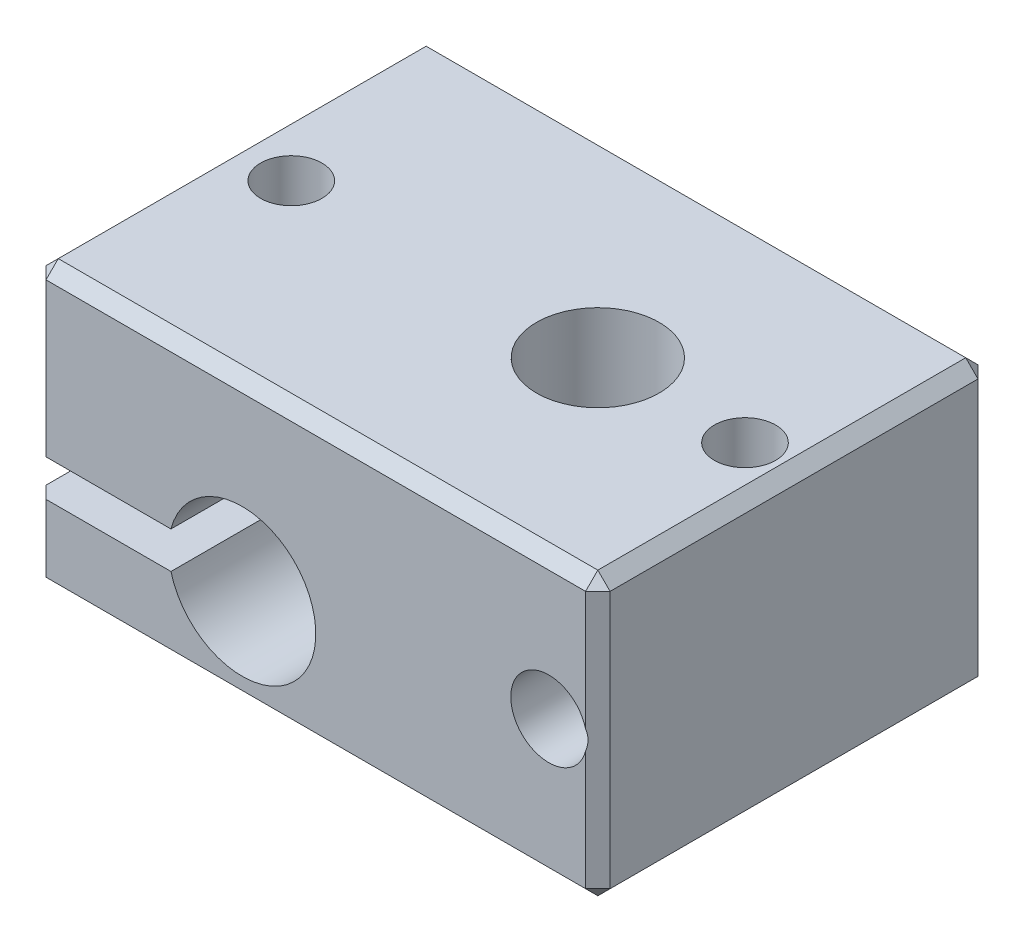
ISO-10303-21;
HEADER;
FILE_DESCRIPTION(('STEP AP214'),'2;1');
FILE_NAME('part.step','',(''),(''),'','','');
FILE_SCHEMA(('AUTOMOTIVE_DESIGN { 1 0 10303 214 1 1 1 1 }'));
ENDSEC;
DATA;
#1=APPLICATION_CONTEXT('core data for automotive mechanical design processes');
#2=APPLICATION_PROTOCOL_DEFINITION('international standard','automotive_design',2000,#1);
#3=PRODUCT_CONTEXT('',#1,'mechanical');
#4=PRODUCT('Part','Part','',(#3));
#5=PRODUCT_RELATED_PRODUCT_CATEGORY('part','',(#4));
#6=PRODUCT_DEFINITION_FORMATION('','',#4);
#7=PRODUCT_DEFINITION_CONTEXT('part definition',#1,'design');
#8=PRODUCT_DEFINITION('design','',#6,#7);
#9=PRODUCT_DEFINITION_SHAPE('','',#8);
#10=(LENGTH_UNIT() NAMED_UNIT(*) SI_UNIT(.MILLI.,.METRE.));
#11=(NAMED_UNIT(*) PLANE_ANGLE_UNIT() SI_UNIT($,.RADIAN.));
#12=(NAMED_UNIT(*) SI_UNIT($,.STERADIAN.) SOLID_ANGLE_UNIT());
#13=UNCERTAINTY_MEASURE_WITH_UNIT(LENGTH_MEASURE(1.E-05),#10,'distance_accuracy_value','');
#14=(GEOMETRIC_REPRESENTATION_CONTEXT(3) GLOBAL_UNCERTAINTY_ASSIGNED_CONTEXT((#13)) GLOBAL_UNIT_ASSIGNED_CONTEXT((#10,
#11,#12)) REPRESENTATION_CONTEXT('',''));
#15=CARTESIAN_POINT('',(0.,0.,0.));
#16=DIRECTION('',(0.,0.,1.));
#17=DIRECTION('',(1.,0.,0.));
#18=AXIS2_PLACEMENT_3D('',#15,#16,#17);
#19=CARTESIAN_POINT('',(0.,11.5,0.));
#20=DIRECTION('',(1.,0.,0.));
#21=DIRECTION('',(0.,0.,-1.));
#22=AXIS2_PLACEMENT_3D('',#19,#20,#21);
#23=PLANE('',#22);
#24=DIRECTION('',(0.,0.,-1.));
#25=VECTOR('',#24,1.);
#26=CARTESIAN_POINT('',(0.,11.,0.));
#27=LINE('',#26,#25);
#28=CARTESIAN_POINT('',(0.,11.,-0.5));
#29=VERTEX_POINT('',#28);
#30=CARTESIAN_POINT('',(0.,11.,-15.5));
#31=VERTEX_POINT('',#30);
#32=EDGE_CURVE('E321',#29,#31,#27,.T.);
#33=ORIENTED_EDGE('',*,*,#32,.T.);
#34=DIRECTION('',(0.,-1.,0.));
#35=VECTOR('',#34,1.);
#36=CARTESIAN_POINT('',(0.,11.5,-15.5));
#37=LINE('',#36,#35);
#38=CARTESIAN_POINT('',(0.,4.75,-15.5));
#39=VERTEX_POINT('',#38);
#40=EDGE_CURVE('E325',#31,#39,#37,.T.);
#41=ORIENTED_EDGE('',*,*,#40,.T.);
#42=DIRECTION('',(0.,0.,1.));
#43=VECTOR('',#42,1.);
#44=CARTESIAN_POINT('',(0.,4.75,-16.));
#45=LINE('',#44,#43);
#46=CARTESIAN_POINT('',(0.,4.75,-0.5));
#47=VERTEX_POINT('',#46);
#48=EDGE_CURVE('E213',#39,#47,#45,.T.);
#49=ORIENTED_EDGE('',*,*,#48,.T.);
#50=DIRECTION('',(0.,1.,0.));
#51=VECTOR('',#50,1.);
#52=CARTESIAN_POINT('',(0.,11.5,-0.5));
#53=LINE('',#52,#51);
#54=EDGE_CURVE('E323',#47,#29,#53,.T.);
#55=ORIENTED_EDGE('',*,*,#54,.T.);
#56=EDGE_LOOP('',(#33,#41,#49,#55));
#57=FACE_BOUND('',#56,.T.);
#58=ADVANCED_FACE('F41',(#57),#23,.F.);
#59=CARTESIAN_POINT('',(2.5,11.5,-8.));
#60=DIRECTION('',(0.,1.,0.));
#61=DIRECTION('',(0.,0.,1.));
#62=AXIS2_PLACEMENT_3D('',#59,#60,#61);
#63=CYLINDRICAL_SURFACE('',#62,1.24999999999999);
#64=CARTESIAN_POINT('',(2.5,11.5,-8.));
#65=DIRECTION('',(0.,1.,0.));
#66=DIRECTION('',(0.,0.,1.));
#67=AXIS2_PLACEMENT_3D('',#64,#65,#66);
#68=CIRCLE('',#67,1.24999999999999);
#69=CARTESIAN_POINT('',(2.5,11.5,-6.75000000000001));
#70=VERTEX_POINT('',#69);
#71=EDGE_CURVE('E224',#70,#70,#68,.T.);
#72=ORIENTED_EDGE('',*,*,#71,.T.);
#73=EDGE_LOOP('',(#72));
#74=FACE_BOUND('',#73,.T.);
#75=CARTESIAN_POINT('',(2.5,4.75,-8.));
#76=DIRECTION('',(0.,-1.,0.));
#77=DIRECTION('',(0.,0.,-1.));
#78=AXIS2_PLACEMENT_3D('',#75,#76,#77);
#79=CIRCLE('',#78,1.24999999999999);
#80=CARTESIAN_POINT('',(2.5,4.75,-9.24999999999999));
#81=VERTEX_POINT('',#80);
#82=EDGE_CURVE('E212',#81,#81,#79,.F.);
#83=ORIENTED_EDGE('',*,*,#82,.F.);
#84=EDGE_LOOP('',(#83));
#85=FACE_BOUND('',#84,.T.);
#86=ADVANCED_FACE('F257',(#74,#85),#63,.F.);
#87=DIRECTION('',(0.,0.,1.));
#88=VECTOR('',#87,1.);
#89=CARTESIAN_POINT('',(0.,3.25,-16.));
#90=LINE('',#89,#88);
#91=CARTESIAN_POINT('',(0.,3.25,-15.5));
#92=VERTEX_POINT('',#91);
#93=CARTESIAN_POINT('',(0.,3.25,-0.5));
#94=VERTEX_POINT('',#93);
#95=EDGE_CURVE('E209',#92,#94,#90,.T.);
#96=ORIENTED_EDGE('',*,*,#95,.F.);
#97=DIRECTION('',(0.,-1.,0.));
#98=VECTOR('',#97,1.);
#99=CARTESIAN_POINT('',(0.,11.5,-15.5));
#100=LINE('',#99,#98);
#101=CARTESIAN_POINT('',(0.,0.500000000000004,-15.5));
#102=VERTEX_POINT('',#101);
#103=EDGE_CURVE('E292',#92,#102,#100,.T.);
#104=ORIENTED_EDGE('',*,*,#103,.T.);
#105=DIRECTION('',(0.,0.,1.));
#106=VECTOR('',#105,1.);
#107=CARTESIAN_POINT('',(0.,0.500000000000004,0.));
#108=LINE('',#107,#106);
#109=CARTESIAN_POINT('',(0.,0.500000000000004,-0.5));
#110=VERTEX_POINT('',#109);
#111=EDGE_CURVE('E303',#102,#110,#108,.T.);
#112=ORIENTED_EDGE('',*,*,#111,.T.);
#113=DIRECTION('',(0.,1.,0.));
#114=VECTOR('',#113,1.);
#115=CARTESIAN_POINT('',(0.,11.5,-0.5));
#116=LINE('',#115,#114);
#117=EDGE_CURVE('E294',#110,#94,#116,.T.);
#118=ORIENTED_EDGE('',*,*,#117,.T.);
#119=EDGE_LOOP('',(#96,#104,#112,#118));
#120=FACE_BOUND('',#119,.T.);
#121=ADVANCED_FACE('F275',(#120),#23,.F.);
#122=CARTESIAN_POINT('',(0.,11.5,0.));
#123=DIRECTION('',(0.,0.,-1.));
#124=DIRECTION('',(-1.,0.,0.));
#125=AXIS2_PLACEMENT_3D('',#122,#123,#124);
#126=PLANE('',#125);
#127=DIRECTION('',(1.,0.,0.));
#128=VECTOR('',#127,1.);
#129=CARTESIAN_POINT('',(0.,3.25,0.));
#130=LINE('',#129,#128);
#131=CARTESIAN_POINT('',(0.500000000000004,3.25,0.));
#132=VERTEX_POINT('',#131);
#133=CARTESIAN_POINT('',(5.59526249034444,3.25,0.));
#134=VERTEX_POINT('',#133);
#135=EDGE_CURVE('E192',#132,#134,#130,.T.);
#136=ORIENTED_EDGE('',*,*,#135,.F.);
#137=DIRECTION('',(0.,-1.,0.));
#138=VECTOR('',#137,1.);
#139=CARTESIAN_POINT('',(0.500000000000004,11.5,0.));
#140=LINE('',#139,#138);
#141=CARTESIAN_POINT('',(0.500000000000004,0.500000000000004,0.));
#142=VERTEX_POINT('',#141);
#143=EDGE_CURVE('E11',#132,#142,#140,.T.);
#144=ORIENTED_EDGE('',*,*,#143,.T.);
#145=DIRECTION('',(1.,0.,0.));
#146=VECTOR('',#145,1.);
#147=CARTESIAN_POINT('',(23.,0.500000000000004,0.));
#148=LINE('',#147,#146);
#149=CARTESIAN_POINT('',(22.5,0.500000000000004,0.));
#150=VERTEX_POINT('',#149);
#151=EDGE_CURVE('E50',#142,#150,#148,.T.);
#152=ORIENTED_EDGE('',*,*,#151,.T.);
#153=DIRECTION('',(0.,1.,0.));
#154=VECTOR('',#153,1.);
#155=CARTESIAN_POINT('',(22.5,11.5,0.));
#156=LINE('',#155,#154);
#157=CARTESIAN_POINT('',(22.5,5.35948751620467,0.));
#158=VERTEX_POINT('',#157);
#159=EDGE_CURVE('E371',#150,#158,#156,.T.);
#160=ORIENTED_EDGE('',*,*,#159,.T.);
#161=CARTESIAN_POINT('',(21.,5.75,0.));
#162=DIRECTION('',(0.,0.,1.));
#163=DIRECTION('',(1.,0.,0.));
#164=AXIS2_PLACEMENT_3D('',#161,#162,#163);
#165=CIRCLE('',#164,1.55);
#166=CARTESIAN_POINT('',(22.5,6.14051248379533,0.));
#167=VERTEX_POINT('',#166);
#168=EDGE_CURVE('E241',#167,#158,#165,.T.);
#169=ORIENTED_EDGE('',*,*,#168,.F.);
#170=DIRECTION('',(0.,1.,0.));
#171=VECTOR('',#170,1.);
#172=CARTESIAN_POINT('',(22.5,11.5,0.));
#173=LINE('',#172,#171);
#174=CARTESIAN_POINT('',(22.5,11.,0.));
#175=VERTEX_POINT('',#174);
#176=EDGE_CURVE('E369',#167,#175,#173,.T.);
#177=ORIENTED_EDGE('',*,*,#176,.T.);
#178=DIRECTION('',(-1.,0.,0.));
#179=VECTOR('',#178,1.);
#180=CARTESIAN_POINT('',(0.,11.,0.));
#181=LINE('',#180,#179);
#182=CARTESIAN_POINT('',(0.500000000000004,11.,0.));
#183=VERTEX_POINT('',#182);
#184=EDGE_CURVE('E365',#175,#183,#181,.T.);
#185=ORIENTED_EDGE('',*,*,#184,.T.);
#186=DIRECTION('',(0.,-1.,0.));
#187=VECTOR('',#186,1.);
#188=CARTESIAN_POINT('',(0.500000000000004,11.5,0.));
#189=LINE('',#188,#187);
#190=CARTESIAN_POINT('',(0.500000000000004,4.75,0.));
#191=VERTEX_POINT('',#190);
#192=EDGE_CURVE('E367',#183,#191,#189,.T.);
#193=ORIENTED_EDGE('',*,*,#192,.T.);
#194=DIRECTION('',(1.,0.,0.));
#195=VECTOR('',#194,1.);
#196=CARTESIAN_POINT('',(0.,4.75,0.));
#197=LINE('',#196,#195);
#198=CARTESIAN_POINT('',(5.59526249034444,4.75,0.));
#199=VERTEX_POINT('',#198);
#200=EDGE_CURVE('E186',#191,#199,#197,.T.);
#201=ORIENTED_EDGE('',*,*,#200,.T.);
#202=CARTESIAN_POINT('',(8.5,4.,0.));
#203=DIRECTION('',(0.,0.,1.));
#204=DIRECTION('',(1.,0.,0.));
#205=AXIS2_PLACEMENT_3D('',#202,#203,#204);
#206=CIRCLE('',#205,3.);
#207=EDGE_CURVE('E206',#134,#199,#206,.T.);
#208=ORIENTED_EDGE('',*,*,#207,.F.);
#209=EDGE_LOOP('',(#136,#144,#152,#160,#169,#177,#185,#193,#201,#208));
#210=FACE_BOUND('',#209,.T.);
#211=ADVANCED_FACE('F283',(#210),#126,.F.);
#212=CARTESIAN_POINT('',(23.,11.5,0.));
#213=DIRECTION('',(-1.,0.,0.));
#214=DIRECTION('',(0.,0.,1.));
#215=AXIS2_PLACEMENT_3D('',#212,#213,#214);
#216=PLANE('',#215);
#217=DIRECTION('',(0.,1.,0.));
#218=VECTOR('',#217,1.);
#219=CARTESIAN_POINT('',(23.,11.5,-15.5));
#220=LINE('',#219,#218);
#221=CARTESIAN_POINT('',(23.,0.500000000000004,-15.5));
#222=VERTEX_POINT('',#221);
#223=CARTESIAN_POINT('',(23.,11.,-15.5));
#224=VERTEX_POINT('',#223);
#225=EDGE_CURVE('E356',#222,#224,#220,.T.);
#226=ORIENTED_EDGE('',*,*,#225,.T.);
#227=DIRECTION('',(0.,0.,1.));
#228=VECTOR('',#227,1.);
#229=CARTESIAN_POINT('',(23.,11.,0.));
#230=LINE('',#229,#228);
#231=CARTESIAN_POINT('',(23.,11.,-0.500000000000004));
#232=VERTEX_POINT('',#231);
#233=EDGE_CURVE('E358',#224,#232,#230,.T.);
#234=ORIENTED_EDGE('',*,*,#233,.T.);
#235=DIRECTION('',(0.,-1.,0.));
#236=VECTOR('',#235,1.);
#237=CARTESIAN_POINT('',(23.,11.5,-0.500000000000004));
#238=LINE('',#237,#236);
#239=CARTESIAN_POINT('',(23.,0.500000000000004,-0.500000000000004));
#240=VERTEX_POINT('',#239);
#241=EDGE_CURVE('E351',#232,#240,#238,.T.);
#242=ORIENTED_EDGE('',*,*,#241,.T.);
#243=DIRECTION('',(0.,0.,-1.));
#244=VECTOR('',#243,1.);
#245=CARTESIAN_POINT('',(23.,0.500000000000004,-16.));
#246=LINE('',#245,#244);
#247=EDGE_CURVE('E353',#240,#222,#246,.T.);
#248=ORIENTED_EDGE('',*,*,#247,.T.);
#249=EDGE_LOOP('',(#226,#234,#242,#248));
#250=FACE_BOUND('',#249,.T.);
#251=ADVANCED_FACE('F288',(#250),#216,.F.);
#252=CARTESIAN_POINT('',(0.,11.5,-16.));
#253=DIRECTION('',(0.,0.,1.));
#254=DIRECTION('',(1.,0.,0.));
#255=AXIS2_PLACEMENT_3D('',#252,#253,#254);
#256=PLANE('',#255);
#257=DIRECTION('',(-1.,0.,0.));
#258=VECTOR('',#257,1.);
#259=CARTESIAN_POINT('',(0.,0.5,-16.));
#260=LINE('',#259,#258);
#261=CARTESIAN_POINT('',(22.5,0.5,-16.));
#262=VERTEX_POINT('',#261);
#263=CARTESIAN_POINT('',(0.5,0.5,-16.));
#264=VERTEX_POINT('',#263);
#265=EDGE_CURVE('E315',#262,#264,#260,.T.);
#266=ORIENTED_EDGE('',*,*,#265,.T.);
#267=DIRECTION('',(0.,1.,0.));
#268=VECTOR('',#267,1.);
#269=CARTESIAN_POINT('',(0.5,11.5,-16.));
#270=LINE('',#269,#268);
#271=CARTESIAN_POINT('',(0.5,3.25,-16.));
#272=VERTEX_POINT('',#271);
#273=EDGE_CURVE('E183',#264,#272,#270,.T.);
#274=ORIENTED_EDGE('',*,*,#273,.T.);
#275=DIRECTION('',(1.,0.,0.));
#276=VECTOR('',#275,1.);
#277=CARTESIAN_POINT('',(0.,3.25,-16.));
#278=LINE('',#277,#276);
#279=CARTESIAN_POINT('',(5.59526249034444,3.25,-16.));
#280=VERTEX_POINT('',#279);
#281=EDGE_CURVE('E176',#272,#280,#278,.T.);
#282=ORIENTED_EDGE('',*,*,#281,.T.);
#283=CARTESIAN_POINT('',(8.5,4.,-16.));
#284=DIRECTION('',(0.,0.,1.));
#285=DIRECTION('',(1.,0.,0.));
#286=AXIS2_PLACEMENT_3D('',#283,#284,#285);
#287=CIRCLE('',#286,3.);
#288=CARTESIAN_POINT('',(5.59526249034444,4.75,-16.));
#289=VERTEX_POINT('',#288);
#290=EDGE_CURVE('E181',#280,#289,#287,.T.);
#291=ORIENTED_EDGE('',*,*,#290,.T.);
#292=DIRECTION('',(1.,0.,0.));
#293=VECTOR('',#292,1.);
#294=CARTESIAN_POINT('',(0.,4.75,-16.));
#295=LINE('',#294,#293);
#296=CARTESIAN_POINT('',(0.5,4.75,-16.));
#297=VERTEX_POINT('',#296);
#298=EDGE_CURVE('E197',#297,#289,#295,.T.);
#299=ORIENTED_EDGE('',*,*,#298,.F.);
#300=DIRECTION('',(0.,1.,0.));
#301=VECTOR('',#300,1.);
#302=CARTESIAN_POINT('',(0.5,11.5,-16.));
#303=LINE('',#302,#301);
#304=CARTESIAN_POINT('',(0.5,11.,-16.));
#305=VERTEX_POINT('',#304);
#306=EDGE_CURVE('E311',#297,#305,#303,.T.);
#307=ORIENTED_EDGE('',*,*,#306,.T.);
#308=DIRECTION('',(1.,0.,0.));
#309=VECTOR('',#308,1.);
#310=CARTESIAN_POINT('',(0.,11.,-16.));
#311=LINE('',#310,#309);
#312=CARTESIAN_POINT('',(22.5,11.,-16.));
#313=VERTEX_POINT('',#312);
#314=EDGE_CURVE('E302',#305,#313,#311,.T.);
#315=ORIENTED_EDGE('',*,*,#314,.T.);
#316=DIRECTION('',(0.,-1.,0.));
#317=VECTOR('',#316,1.);
#318=CARTESIAN_POINT('',(22.5,11.5,-16.));
#319=LINE('',#318,#317);
#320=CARTESIAN_POINT('',(22.5,6.14051248379533,-16.));
#321=VERTEX_POINT('',#320);
#322=EDGE_CURVE('E305',#313,#321,#319,.T.);
#323=ORIENTED_EDGE('',*,*,#322,.T.);
#324=CARTESIAN_POINT('',(21.,5.75,-16.));
#325=DIRECTION('',(0.,0.,1.));
#326=DIRECTION('',(1.,0.,0.));
#327=AXIS2_PLACEMENT_3D('',#324,#325,#326);
#328=CIRCLE('',#327,1.55);
#329=CARTESIAN_POINT('',(22.5,5.35948751620467,-16.));
#330=VERTEX_POINT('',#329);
#331=EDGE_CURVE('E242',#321,#330,#328,.T.);
#332=ORIENTED_EDGE('',*,*,#331,.T.);
#333=DIRECTION('',(0.,-1.,0.));
#334=VECTOR('',#333,1.);
#335=CARTESIAN_POINT('',(22.5,11.5,-16.));
#336=LINE('',#335,#334);
#337=EDGE_CURVE('E313',#330,#262,#336,.T.);
#338=ORIENTED_EDGE('',*,*,#337,.T.);
#339=EDGE_LOOP('',(#266,#274,#282,#291,#299,#307,#315,#323,#332,#338));
#340=FACE_BOUND('',#339,.T.);
#341=ADVANCED_FACE('F178',(#340),#256,.F.);
#342=CARTESIAN_POINT('',(0.,11.5,0.));
#343=DIRECTION('',(0.,-1.,0.));
#344=DIRECTION('',(0.,0.,-1.));
#345=AXIS2_PLACEMENT_3D('',#342,#343,#344);
#346=PLANE('',#345);
#347=DIRECTION('',(1.,0.,0.));
#348=VECTOR('',#347,1.);
#349=CARTESIAN_POINT('',(0.,11.5,-0.500000000000004));
#350=LINE('',#349,#348);
#351=CARTESIAN_POINT('',(0.500000000000004,11.5,-0.500000000000004));
#352=VERTEX_POINT('',#351);
#353=CARTESIAN_POINT('',(22.5,11.5,-0.500000000000004));
#354=VERTEX_POINT('',#353);
#355=EDGE_CURVE('E346',#352,#354,#350,.T.);
#356=ORIENTED_EDGE('',*,*,#355,.T.);
#357=DIRECTION('',(0.,0.,-1.));
#358=VECTOR('',#357,1.);
#359=CARTESIAN_POINT('',(22.5,11.5,0.));
#360=LINE('',#359,#358);
#361=CARTESIAN_POINT('',(22.5,11.5,-15.5));
#362=VERTEX_POINT('',#361);
#363=EDGE_CURVE('E348',#354,#362,#360,.T.);
#364=ORIENTED_EDGE('',*,*,#363,.T.);
#365=DIRECTION('',(-1.,0.,0.));
#366=VECTOR('',#365,1.);
#367=CARTESIAN_POINT('',(0.,11.5,-15.5));
#368=LINE('',#367,#366);
#369=CARTESIAN_POINT('',(0.500000000000004,11.5,-15.5));
#370=VERTEX_POINT('',#369);
#371=EDGE_CURVE('E342',#362,#370,#368,.T.);
#372=ORIENTED_EDGE('',*,*,#371,.T.);
#373=DIRECTION('',(0.,0.,1.));
#374=VECTOR('',#373,1.);
#375=CARTESIAN_POINT('',(0.500000000000004,11.5,0.));
#376=LINE('',#375,#374);
#377=EDGE_CURVE('E344',#370,#352,#376,.T.);
#378=ORIENTED_EDGE('',*,*,#377,.T.);
#379=EDGE_LOOP('',(#356,#364,#372,#378));
#380=FACE_BOUND('',#379,.T.);
#381=CARTESIAN_POINT('',(15.,11.5,-8.));
#382=DIRECTION('',(0.,1.,0.));
#383=DIRECTION('',(0.,0.,1.));
#384=AXIS2_PLACEMENT_3D('',#381,#382,#383);
#385=CIRCLE('',#384,2.49999999999999);
#386=CARTESIAN_POINT('',(15.,11.5,-5.50000000000001));
#387=VERTEX_POINT('',#386);
#388=EDGE_CURVE('E217',#387,#387,#385,.T.);
#389=ORIENTED_EDGE('',*,*,#388,.F.);
#390=EDGE_LOOP('',(#389));
#391=FACE_BOUND('',#390,.T.);
#392=ORIENTED_EDGE('',*,*,#71,.F.);
#393=EDGE_LOOP('',(#392));
#394=FACE_BOUND('',#393,.T.);
#395=CARTESIAN_POINT('',(21.,11.5,-8.));
#396=DIRECTION('',(0.,1.,0.));
#397=DIRECTION('',(0.,0.,1.));
#398=AXIS2_PLACEMENT_3D('',#395,#396,#397);
#399=CIRCLE('',#398,1.24999999999999);
#400=CARTESIAN_POINT('',(21.,11.5,-6.75000000000001));
#401=VERTEX_POINT('',#400);
#402=EDGE_CURVE('E230',#401,#401,#399,.T.);
#403=ORIENTED_EDGE('',*,*,#402,.F.);
#404=EDGE_LOOP('',(#403));
#405=FACE_BOUND('',#404,.T.);
#406=ADVANCED_FACE('F488',(#380,#391,#394,#405),#346,.F.);
#407=CARTESIAN_POINT('',(0.,0.,0.));
#408=DIRECTION('',(0.,-1.,0.));
#409=DIRECTION('',(0.,0.,-1.));
#410=AXIS2_PLACEMENT_3D('',#407,#408,#409);
#411=PLANE('',#410);
#412=DIRECTION('',(-1.,0.,0.));
#413=VECTOR('',#412,1.);
#414=CARTESIAN_POINT('',(0.,0.,-0.5));
#415=LINE('',#414,#413);
#416=CARTESIAN_POINT('',(22.5,0.,-0.5));
#417=VERTEX_POINT('',#416);
#418=CARTESIAN_POINT('',(0.5,0.,-0.5));
#419=VERTEX_POINT('',#418);
#420=EDGE_CURVE('E331',#417,#419,#415,.T.);
#421=ORIENTED_EDGE('',*,*,#420,.T.);
#422=DIRECTION('',(0.,0.,-1.));
#423=VECTOR('',#422,1.);
#424=CARTESIAN_POINT('',(0.5,0.,-16.));
#425=LINE('',#424,#423);
#426=CARTESIAN_POINT('',(0.5,0.,-15.5));
#427=VERTEX_POINT('',#426);
#428=EDGE_CURVE('E339',#419,#427,#425,.T.);
#429=ORIENTED_EDGE('',*,*,#428,.T.);
#430=DIRECTION('',(1.,0.,0.));
#431=VECTOR('',#430,1.);
#432=CARTESIAN_POINT('',(23.,0.,-15.5));
#433=LINE('',#432,#431);
#434=CARTESIAN_POINT('',(22.5,0.,-15.5));
#435=VERTEX_POINT('',#434);
#436=EDGE_CURVE('E337',#427,#435,#433,.T.);
#437=ORIENTED_EDGE('',*,*,#436,.T.);
#438=DIRECTION('',(0.,0.,1.));
#439=VECTOR('',#438,1.);
#440=CARTESIAN_POINT('',(22.5,0.,0.));
#441=LINE('',#440,#439);
#442=EDGE_CURVE('E334',#435,#417,#441,.T.);
#443=ORIENTED_EDGE('',*,*,#442,.T.);
#444=EDGE_LOOP('',(#421,#429,#437,#443));
#445=FACE_BOUND('',#444,.T.);
#446=CARTESIAN_POINT('',(15.,0.,-8.));
#447=DIRECTION('',(0.,1.,0.));
#448=DIRECTION('',(0.,0.,1.));
#449=AXIS2_PLACEMENT_3D('',#446,#447,#448);
#450=CIRCLE('',#449,2.5);
#451=CARTESIAN_POINT('',(15.,0.,-5.50000000000001));
#452=VERTEX_POINT('',#451);
#453=EDGE_CURVE('E220',#452,#452,#450,.T.);
#454=ORIENTED_EDGE('',*,*,#453,.T.);
#455=EDGE_LOOP('',(#454));
#456=FACE_BOUND('',#455,.T.);
#457=CARTESIAN_POINT('',(2.5,0.,-8.));
#458=DIRECTION('',(0.,-1.,0.));
#459=DIRECTION('',(0.,0.,-1.));
#460=AXIS2_PLACEMENT_3D('',#457,#458,#459);
#461=CIRCLE('',#460,1.24999999999999);
#462=CARTESIAN_POINT('',(2.5,0.,-9.24999999999999));
#463=VERTEX_POINT('',#462);
#464=EDGE_CURVE('E227',#463,#463,#461,.T.);
#465=ORIENTED_EDGE('',*,*,#464,.F.);
#466=EDGE_LOOP('',(#465));
#467=FACE_BOUND('',#466,.T.);
#468=ADVANCED_FACE('F486',(#445,#456,#467),#411,.T.);
#469=CARTESIAN_POINT('',(21.,5.75,-16.));
#470=DIRECTION('',(0.,0.,1.));
#471=DIRECTION('',(1.,0.,0.));
#472=AXIS2_PLACEMENT_3D('',#469,#470,#471);
#473=CYLINDRICAL_SURFACE('',#472,1.55);
#474=CARTESIAN_POINT('',(21.,7.3,-6.75000000000001));
#475=CARTESIAN_POINT('',(21.0598892809909,7.29999505953035,-6.75000508060894));
#476=CARTESIAN_POINT('',(21.1198448147391,7.29649449353118,-6.75433869661009));
#477=CARTESIAN_POINT('',(21.2378088351429,7.28280476443067,-6.77137677750278));
#478=CARTESIAN_POINT('',(21.2958137707061,7.2726040304315,-6.78409572363545));
#479=CARTESIAN_POINT('',(21.4078652549227,7.24647462705167,-6.81698036290084));
#480=CARTESIAN_POINT('',(21.4619340004093,7.23058165445636,-6.83709966815181));
#481=CARTESIAN_POINT('',(21.5654950318761,7.19420715596626,-6.88377997849981));
#482=CARTESIAN_POINT('',(21.6149867430684,7.17372505486709,-6.91034179113944));
#483=CARTESIAN_POINT('',(21.7254535915895,7.12154799488093,-6.97930258260524));
#484=CARTESIAN_POINT('',(21.7843376032748,7.08844407130947,-7.02398499785542));
#485=CARTESIAN_POINT('',(21.8925143949093,7.01888548996761,-7.12178538227406));
#486=CARTESIAN_POINT('',(21.9417788955574,6.98242140316723,-7.17492741367408));
#487=CARTESIAN_POINT('',(22.0311676485552,6.90870438902473,-7.28966264719342));
#488=CARTESIAN_POINT('',(22.0711301918294,6.87144827814355,-7.35137925512715));
#489=CARTESIAN_POINT('',(22.1403077996914,6.80100245223141,-7.48262669648232));
#490=CARTESIAN_POINT('',(22.1695581057008,6.76779964731762,-7.55213090619391));
#491=CARTESIAN_POINT('',(22.2057720399277,6.72419167436202,-7.66753628450255));
#492=CARTESIAN_POINT('',(22.2169094735222,6.71012489387374,-7.71072180027161));
#493=CARTESIAN_POINT('',(22.234610614028,6.68725468393275,-7.7993299426072));
#494=CARTESIAN_POINT('',(22.2411856736356,6.6784381978257,-7.84474671300843));
#495=CARTESIAN_POINT('',(22.2492963489852,6.66750313955801,-7.93730983081388));
#496=CARTESIAN_POINT('',(22.25078441298,6.66544777506487,-7.98446835509039));
#497=CARTESIAN_POINT('',(22.2484246653356,6.66866072212834,-8.07841239593764));
#498=CARTESIAN_POINT('',(22.2445729314499,6.67393441711259,-8.12519761290679));
#499=CARTESIAN_POINT('',(22.2309972258897,6.69195759613478,-8.22351250695992));
#500=CARTESIAN_POINT('',(22.2205038602474,6.70567881731784,-8.27474850566073));
#501=CARTESIAN_POINT('',(22.1938885766394,6.73872575660048,-8.37387252409465));
#502=CARTESIAN_POINT('',(22.1777496322926,6.7580683980236,-8.42174988421069));
#503=CARTESIAN_POINT('',(22.1310094406375,6.81070572623625,-8.53756461204011));
#504=CARTESIAN_POINT('',(22.0972315313788,6.84608098010005,-8.60326000663281));
#505=CARTESIAN_POINT('',(22.0194331392835,6.9188099095198,-8.72705224000209));
#506=CARTESIAN_POINT('',(21.9753970332117,6.95616653499973,-8.78513727522479));
#507=CARTESIAN_POINT('',(21.8758099163534,7.03040472376249,-8.89505245788434));
#508=CARTESIAN_POINT('',(21.8199481575349,7.06723688801658,-8.94663723347919));
#509=CARTESIAN_POINT('',(21.6978506617392,7.13577751282476,-9.03988910513875));
#510=CARTESIAN_POINT('',(21.6316427829299,7.16749928091645,-9.08158209805518));
#511=CARTESIAN_POINT('',(21.5098977173949,7.21474707386757,-9.14269044564161));
#512=CARTESIAN_POINT('',(21.4566408765756,7.2323160847474,-9.16507133834711));
#513=CARTESIAN_POINT('',(21.3461495843918,7.26193298467064,-9.20252818181064));
#514=CARTESIAN_POINT('',(21.2889181259619,7.27398497727426,-9.21760956242861));
#515=CARTESIAN_POINT('',(21.1715704515023,7.29162268594998,-9.23961455198698));
#516=CARTESIAN_POINT('',(21.1114399190763,7.29717194073946,-9.2464921656788));
#517=CARTESIAN_POINT('',(20.9905837258055,7.30114876216378,-9.25142520240247));
#518=CARTESIAN_POINT('',(20.9298582216542,7.29957815613483,-9.24948288909802));
#519=CARTESIAN_POINT('',(20.8152039172759,7.28992554933875,-9.23748986080134));
#520=CARTESIAN_POINT('',(20.7611460690776,7.28242661712228,-9.22816511589808));
#521=CARTESIAN_POINT('',(20.6556402375184,7.26221815510165,-9.20285561393917));
#522=CARTESIAN_POINT('',(20.6041929745746,7.2495071956801,-9.18686902957461));
#523=CARTESIAN_POINT('',(20.5022086478295,7.21890820831292,-9.14797367430534));
#524=CARTESIAN_POINT('',(20.4518710966453,7.20077748295283,-9.12473744786645));
#525=CARTESIAN_POINT('',(20.355856522653,7.16077569163576,-9.07264430581038));
#526=CARTESIAN_POINT('',(20.3101799176724,7.13890429081785,-9.04378688695842));
#527=CARTESIAN_POINT('',(20.2157113316926,7.08819786080361,-8.97539690304484));
#528=CARTESIAN_POINT('',(20.1679254732775,7.05882471485253,-8.93487713938917));
#529=CARTESIAN_POINT('',(20.0793811771997,6.99813951208407,-8.84783597771722));
#530=CARTESIAN_POINT('',(20.0386412299283,6.96682263818445,-8.80129933210377));
#531=CARTESIAN_POINT('',(19.9561959935474,6.89737529170475,-8.69185660593384));
#532=CARTESIAN_POINT('',(19.9162555252007,6.85926377626068,-8.62760293032897));
#533=CARTESIAN_POINT('',(19.8478431620607,6.78800087709493,-8.49076440792984));
#534=CARTESIAN_POINT('',(19.8193310685618,6.75483236997761,-8.41820993760923));
#535=CARTESIAN_POINT('',(19.7857156135062,6.7135236356013,-8.2998022729641));
#536=CARTESIAN_POINT('',(19.7758691551371,6.70087263708787,-8.25689909777401));
#537=CARTESIAN_POINT('',(19.760697738843,6.68101400282114,-8.16912598483131));
#538=CARTESIAN_POINT('',(19.7553607091243,6.67379183977493,-8.12426163838878));
#539=CARTESIAN_POINT('',(19.7496074772535,6.66599519255235,-8.03327021983177));
#540=CARTESIAN_POINT('',(19.7492282090002,6.66547060405519,-7.98713623316749));
#541=CARTESIAN_POINT('',(19.7535270457042,6.67131154788122,-7.8955236754066));
#542=CARTESIAN_POINT('',(19.7582114905678,6.67768571764927,-7.85004599834568));
#543=CARTESIAN_POINT('',(19.7737006712015,6.69809310587994,-7.75166455110301));
#544=CARTESIAN_POINT('',(19.7855887187391,6.71345918270951,-7.69921996933638));
#545=CARTESIAN_POINT('',(19.8152276777066,6.74968065615885,-7.59798694483358));
#546=CARTESIAN_POINT('',(19.8329962121485,6.77055251422297,-7.54921003950756));
#547=CARTESIAN_POINT('',(19.8838386039326,6.82643894670566,-7.43206081655783));
#548=CARTESIAN_POINT('',(19.9201309292342,6.86332890776581,-7.365989189603));
#549=CARTESIAN_POINT('',(20.0033909854416,6.93846144459808,-7.24180437633994));
#550=CARTESIAN_POINT('',(20.0503733291858,6.97670581079817,-7.18370225993714));
#551=CARTESIAN_POINT('',(20.1559975012151,7.05171201314048,-7.07477626837596));
#552=CARTESIAN_POINT('',(20.2148752883537,7.08842199799482,-7.02414288649723));
#553=CARTESIAN_POINT('',(20.3432637669878,7.15585152676002,-6.93354537955849));
#554=CARTESIAN_POINT('',(20.4127446437394,7.18658733490329,-6.89355217464128));
#555=CARTESIAN_POINT('',(20.5381276521099,7.23058708062425,-6.83709723896432));
#556=CARTESIAN_POINT('',(20.5916200322532,7.24631659405098,-6.81718175872221));
#557=CARTESIAN_POINT('',(20.7020324865238,7.27213886041913,-6.78467868737254));
#558=CARTESIAN_POINT('',(20.7589442912598,7.28224465020892,-6.77207414524025));
#559=CARTESIAN_POINT('',(20.8469674667265,7.29272840748518,-6.75902582695261));
#560=CARTESIAN_POINT('',(20.8774023943753,7.29544727545072,-6.75564911961083));
#561=CARTESIAN_POINT('',(20.9385523526711,7.29908457043244,-6.75113461517087));
#562=CARTESIAN_POINT('',(20.9692674531951,7.30000253523189,-6.7499973928548));
#563=CARTESIAN_POINT('',(21.,7.3,-6.75000000000001));
#564=B_SPLINE_CURVE_WITH_KNOTS('',3,(#474,#475,#476,#477,#478,#479,#480,#481,#482,#483,#484,
#485,#486,#487,#488,#489,#490,#491,#492,#493,#494,#495,#496,#497,#498,#499,#500,#501,#502,#503,
#504,#505,#506,#507,#508,#509,#510,#511,#512,#513,#514,#515,#516,#517,#518,#519,#520,#521,#522,
#523,#524,#525,#526,#527,#528,#529,#530,#531,#532,#533,#534,#535,#536,#537,#538,#539,#540,#541,
#542,#543,#544,#545,#546,#547,#548,#549,#550,#551,#552,#553,#554,#555,#556,#557,#558,#559,#560,
#561,#562,#563),.UNSPECIFIED.,.T.,.F.,(4,2,2,2,2,2,2,2,2,2,2,2,2,2,2,2,2,2,2,2,2,2,2,2,2,2,2,2,
2,2,2,2,2,2,2,2,2,2,2,2,2,2,2,2,4),(0.,0.179535311511328,0.359381490753361,0.538119030068404,
0.716878985009277,0.958570636850723,1.20096245267446,1.44729699706566,1.69281370429632,
1.83266576288543,1.97216856312845,2.11297188092433,2.25387867792389,2.41518443643971,
2.57698092846957,2.82140413865395,3.06620206772521,3.31848042397408,3.57009083754102,
3.75051776685532,3.93081027562205,4.11210893141238,4.29336105892792,4.45871899738408,
4.62412232257373,4.79846616240424,4.97282561746978,5.17968312904773,5.3870755149526,
5.6401599939378,5.8923462805338,6.02928614815345,6.16585825407619,6.3034472080622,
6.44120862689027,6.60805388422725,6.77540375142224,7.02587593947765,7.27669259242031,
7.53308453039102,7.78876837221905,7.96569484430799,8.1422094405581,8.23431543497626,
8.32644506607001),.UNSPECIFIED.);
#565=CARTESIAN_POINT('',(21.,7.3,-6.75000000000001));
#566=VERTEX_POINT('',#565);
#567=EDGE_CURVE('E233',#566,#566,#564,.T.);
#568=ORIENTED_EDGE('',*,*,#567,.T.);
#569=EDGE_LOOP('',(#568));
#570=FACE_BOUND('',#569,.T.);
#571=ORIENTED_EDGE('',*,*,#331,.F.);
#572=CARTESIAN_POINT('',(21.,5.75,-17.5));
#573=DIRECTION('',(-0.70710678118655,0.,0.707106781186545));
#574=DIRECTION('',(0.707106781186545,0.,0.70710678118655));
#575=AXIS2_PLACEMENT_3D('',#572,#573,#574);
#576=ELLIPSE('',#575,2.19203102167831,1.55);
#577=EDGE_CURVE('E363',#321,#330,#576,.F.);
#578=ORIENTED_EDGE('',*,*,#577,.T.);
#579=EDGE_LOOP('',(#571,#578));
#580=FACE_BOUND('',#579,.T.);
#581=ORIENTED_EDGE('',*,*,#168,.T.);
#582=CARTESIAN_POINT('',(21.,5.75,1.50000000000001));
#583=DIRECTION('',(-0.70710678118655,0.,-0.707106781186545));
#584=DIRECTION('',(-0.707106781186545,0.,0.70710678118655));
#585=AXIS2_PLACEMENT_3D('',#582,#583,#584);
#586=ELLIPSE('',#585,2.19203102167831,1.55);
#587=EDGE_CURVE('E361',#158,#167,#586,.F.);
#588=ORIENTED_EDGE('',*,*,#587,.T.);
#589=EDGE_LOOP('',(#581,#588));
#590=FACE_BOUND('',#589,.T.);
#591=ADVANCED_FACE('F251',(#570,#580,#590),#473,.F.);
#592=CARTESIAN_POINT('',(21.,11.5,-8.));
#593=DIRECTION('',(0.,1.,0.));
#594=DIRECTION('',(0.,0.,1.));
#595=AXIS2_PLACEMENT_3D('',#592,#593,#594);
#596=CYLINDRICAL_SURFACE('',#595,1.24999999999999);
#597=ORIENTED_EDGE('',*,*,#567,.F.);
#598=EDGE_LOOP('',(#597));
#599=FACE_BOUND('',#598,.T.);
#600=ORIENTED_EDGE('',*,*,#402,.T.);
#601=EDGE_LOOP('',(#600));
#602=FACE_BOUND('',#601,.T.);
#603=ADVANCED_FACE('F246',(#599,#602),#596,.F.);
#604=CARTESIAN_POINT('',(2.5,3.25,-8.));
#605=DIRECTION('',(0.,-1.,0.));
#606=DIRECTION('',(0.,0.,-1.));
#607=AXIS2_PLACEMENT_3D('',#604,#605,#606);
#608=CIRCLE('',#607,1.24999999999999);
#609=CARTESIAN_POINT('',(2.5,3.25,-9.24999999999999));
#610=VERTEX_POINT('',#609);
#611=EDGE_CURVE('E221',#610,#610,#608,.F.);
#612=ORIENTED_EDGE('',*,*,#611,.T.);
#613=EDGE_LOOP('',(#612));
#614=FACE_BOUND('',#613,.T.);
#615=ORIENTED_EDGE('',*,*,#464,.T.);
#616=EDGE_LOOP('',(#615));
#617=FACE_BOUND('',#616,.T.);
#618=ADVANCED_FACE('F250',(#614,#617),#63,.F.);
#619=CARTESIAN_POINT('',(15.,11.5,-8.));
#620=DIRECTION('',(0.,1.,0.));
#621=DIRECTION('',(0.,0.,1.));
#622=AXIS2_PLACEMENT_3D('',#619,#620,#621);
#623=CYLINDRICAL_SURFACE('',#622,2.49999999999999);
#624=ORIENTED_EDGE('',*,*,#453,.F.);
#625=EDGE_LOOP('',(#624));
#626=FACE_BOUND('',#625,.T.);
#627=ORIENTED_EDGE('',*,*,#388,.T.);
#628=EDGE_LOOP('',(#627));
#629=FACE_BOUND('',#628,.T.);
#630=ADVANCED_FACE('F255',(#626,#629),#623,.F.);
#631=CARTESIAN_POINT('',(0.,3.25,-16.));
#632=DIRECTION('',(0.,-1.,0.));
#633=DIRECTION('',(0.,0.,-1.));
#634=AXIS2_PLACEMENT_3D('',#631,#632,#633);
#635=PLANE('',#634);
#636=ORIENTED_EDGE('',*,*,#281,.F.);
#637=DIRECTION('',(0.707106781186545,0.,-0.70710678118655));
#638=VECTOR('',#637,1.);
#639=CARTESIAN_POINT('',(0.,3.25,-15.5));
#640=LINE('',#639,#638);
#641=EDGE_CURVE('E298',#272,#92,#640,.F.);
#642=ORIENTED_EDGE('',*,*,#641,.T.);
#643=ORIENTED_EDGE('',*,*,#95,.T.);
#644=DIRECTION('',(-0.70710678118655,0.,-0.707106781186545));
#645=VECTOR('',#644,1.);
#646=CARTESIAN_POINT('',(0.500000000000004,3.25,0.));
#647=LINE('',#646,#645);
#648=EDGE_CURVE('E318',#94,#132,#647,.F.);
#649=ORIENTED_EDGE('',*,*,#648,.T.);
#650=ORIENTED_EDGE('',*,*,#135,.T.);
#651=DIRECTION('',(0.,0.,1.));
#652=VECTOR('',#651,1.);
#653=CARTESIAN_POINT('',(5.59526249034444,3.25,-16.));
#654=LINE('',#653,#652);
#655=EDGE_CURVE('E189',#280,#134,#654,.T.);
#656=ORIENTED_EDGE('',*,*,#655,.F.);
#657=EDGE_LOOP('',(#636,#642,#643,#649,#650,#656));
#658=FACE_BOUND('',#657,.T.);
#659=ORIENTED_EDGE('',*,*,#611,.F.);
#660=EDGE_LOOP('',(#659));
#661=FACE_BOUND('',#660,.T.);
#662=ADVANCED_FACE('F190',(#658,#661),#635,.F.);
#663=CARTESIAN_POINT('',(0.,4.75,-16.));
#664=DIRECTION('',(0.,-1.,0.));
#665=DIRECTION('',(0.,0.,-1.));
#666=AXIS2_PLACEMENT_3D('',#663,#664,#665);
#667=PLANE('',#666);
#668=ORIENTED_EDGE('',*,*,#48,.F.);
#669=DIRECTION('',(-0.707106781186545,0.,0.70710678118655));
#670=VECTOR('',#669,1.);
#671=CARTESIAN_POINT('',(0.250000000000002,4.75,-15.75));
#672=LINE('',#671,#670);
#673=EDGE_CURVE('E329',#39,#297,#672,.F.);
#674=ORIENTED_EDGE('',*,*,#673,.T.);
#675=ORIENTED_EDGE('',*,*,#298,.T.);
#676=DIRECTION('',(0.,0.,1.));
#677=VECTOR('',#676,1.);
#678=CARTESIAN_POINT('',(5.59526249034444,4.75,-16.));
#679=LINE('',#678,#677);
#680=EDGE_CURVE('E196',#289,#199,#679,.T.);
#681=ORIENTED_EDGE('',*,*,#680,.T.);
#682=ORIENTED_EDGE('',*,*,#200,.F.);
#683=DIRECTION('',(0.70710678118655,0.,0.707106781186545));
#684=VECTOR('',#683,1.);
#685=CARTESIAN_POINT('',(-7.75,4.75,-8.24999999999995));
#686=LINE('',#685,#684);
#687=EDGE_CURVE('E327',#191,#47,#686,.F.);
#688=ORIENTED_EDGE('',*,*,#687,.T.);
#689=EDGE_LOOP('',(#668,#674,#675,#681,#682,#688));
#690=FACE_BOUND('',#689,.T.);
#691=ORIENTED_EDGE('',*,*,#82,.T.);
#692=EDGE_LOOP('',(#691));
#693=FACE_BOUND('',#692,.T.);
#694=ADVANCED_FACE('F263',(#690,#693),#667,.T.);
#695=CARTESIAN_POINT('',(8.5,4.,-16.));
#696=DIRECTION('',(0.,0.,1.));
#697=DIRECTION('',(1.,0.,0.));
#698=AXIS2_PLACEMENT_3D('',#695,#696,#697);
#699=CYLINDRICAL_SURFACE('',#698,3.);
#700=ORIENTED_EDGE('',*,*,#207,.T.);
#701=ORIENTED_EDGE('',*,*,#680,.F.);
#702=ORIENTED_EDGE('',*,*,#290,.F.);
#703=ORIENTED_EDGE('',*,*,#655,.T.);
#704=EDGE_LOOP('',(#700,#701,#702,#703));
#705=FACE_BOUND('',#704,.T.);
#706=ADVANCED_FACE('F200',(#705),#699,.F.);
#707=CARTESIAN_POINT('',(0.500000000000004,11.5,0.));
#708=DIRECTION('',(0.707106781186545,0.,-0.70710678118655));
#709=DIRECTION('',(0.,-1.,0.));
#710=AXIS2_PLACEMENT_3D('',#707,#708,#709);
#711=PLANE('',#710);
#712=DIRECTION('',(-0.70710678118655,0.,-0.707106781186545));
#713=VECTOR('',#712,1.);
#714=CARTESIAN_POINT('',(0.,11.,-0.5));
#715=LINE('',#714,#713);
#716=EDGE_CURVE('E45',#29,#183,#715,.F.);
#717=ORIENTED_EDGE('',*,*,#716,.F.);
#718=ORIENTED_EDGE('',*,*,#54,.F.);
#719=ORIENTED_EDGE('',*,*,#687,.F.);
#720=ORIENTED_EDGE('',*,*,#192,.F.);
#721=EDGE_LOOP('',(#717,#718,#719,#720));
#722=FACE_BOUND('',#721,.T.);
#723=ADVANCED_FACE('F43',(#722),#711,.F.);
#724=CARTESIAN_POINT('',(0.,11.,-0.5));
#725=DIRECTION('',(-0.577350269189622,0.57735026918963,0.577350269189626));
#726=DIRECTION('',(0.,-0.707106781186545,0.70710678118655));
#727=AXIS2_PLACEMENT_3D('',#724,#725,#726);
#728=PLANE('',#727);
#729=DIRECTION('',(0.70710678118655,0.707106781186545,0.));
#730=VECTOR('',#729,1.);
#731=CARTESIAN_POINT('',(0.,11.,-0.5));
#732=LINE('',#731,#730);
#733=EDGE_CURVE('E433',#29,#352,#732,.T.);
#734=ORIENTED_EDGE('',*,*,#733,.F.);
#735=ORIENTED_EDGE('',*,*,#716,.T.);
#736=DIRECTION('',(0.,-0.707106781186545,0.70710678118655));
#737=VECTOR('',#736,1.);
#738=CARTESIAN_POINT('',(0.500000000000004,11.25,-0.250000000000002));
#739=LINE('',#738,#737);
#740=EDGE_CURVE('E435',#352,#183,#739,.T.);
#741=ORIENTED_EDGE('',*,*,#740,.F.);
#742=EDGE_LOOP('',(#734,#735,#741));
#743=FACE_BOUND('',#742,.T.);
#744=ADVANCED_FACE('F445',(#743),#728,.T.);
#745=CARTESIAN_POINT('',(0.,11.5,-0.500000000000004));
#746=DIRECTION('',(0.,-0.70710678118655,-0.707106781186545));
#747=DIRECTION('',(1.,0.,0.));
#748=AXIS2_PLACEMENT_3D('',#745,#746,#747);
#749=PLANE('',#748);
#750=ORIENTED_EDGE('',*,*,#740,.T.);
#751=ORIENTED_EDGE('',*,*,#184,.F.);
#752=DIRECTION('',(0.,0.707106781186545,-0.70710678118655));
#753=VECTOR('',#752,1.);
#754=CARTESIAN_POINT('',(22.5,11.25,-0.250000000000002));
#755=LINE('',#754,#753);
#756=EDGE_CURVE('E430',#354,#175,#755,.F.);
#757=ORIENTED_EDGE('',*,*,#756,.F.);
#758=ORIENTED_EDGE('',*,*,#355,.F.);
#759=EDGE_LOOP('',(#750,#751,#757,#758));
#760=FACE_BOUND('',#759,.T.);
#761=ADVANCED_FACE('F536',(#760),#749,.F.);
#762=CARTESIAN_POINT('',(0.500000000000004,11.5,0.));
#763=DIRECTION('',(0.707106781186545,-0.70710678118655,0.));
#764=DIRECTION('',(0.,0.,1.));
#765=AXIS2_PLACEMENT_3D('',#762,#763,#764);
#766=PLANE('',#765);
#767=ORIENTED_EDGE('',*,*,#733,.T.);
#768=ORIENTED_EDGE('',*,*,#377,.F.);
#769=DIRECTION('',(-0.70710678118655,-0.707106781186545,0.));
#770=VECTOR('',#769,1.);
#771=CARTESIAN_POINT('',(0.250000000000002,11.25,-15.5));
#772=LINE('',#771,#770);
#773=EDGE_CURVE('E427',#31,#370,#772,.F.);
#774=ORIENTED_EDGE('',*,*,#773,.F.);
#775=ORIENTED_EDGE('',*,*,#32,.F.);
#776=EDGE_LOOP('',(#767,#768,#774,#775));
#777=FACE_BOUND('',#776,.T.);
#778=ADVANCED_FACE('F549',(#777),#766,.F.);
#779=CARTESIAN_POINT('',(0.,11.5,-15.5));
#780=DIRECTION('',(0.70710678118655,0.,0.707106781186545));
#781=DIRECTION('',(0.,-1.,0.));
#782=AXIS2_PLACEMENT_3D('',#779,#780,#781);
#783=PLANE('',#782);
#784=ORIENTED_EDGE('',*,*,#673,.F.);
#785=ORIENTED_EDGE('',*,*,#40,.F.);
#786=DIRECTION('',(0.707106781186545,0.,-0.70710678118655));
#787=VECTOR('',#786,1.);
#788=CARTESIAN_POINT('',(0.5,11.,-16.));
#789=LINE('',#788,#787);
#790=EDGE_CURVE('E424',#305,#31,#789,.F.);
#791=ORIENTED_EDGE('',*,*,#790,.F.);
#792=ORIENTED_EDGE('',*,*,#306,.F.);
#793=EDGE_LOOP('',(#784,#785,#791,#792));
#794=FACE_BOUND('',#793,.T.);
#795=ADVANCED_FACE('F541',(#794),#783,.F.);
#796=CARTESIAN_POINT('',(23.,11.,-0.500000000000004));
#797=DIRECTION('',(0.577350269189626,0.57735026918963,0.577350269189622));
#798=DIRECTION('',(-0.70710678118655,0.707106781186545,0.));
#799=AXIS2_PLACEMENT_3D('',#796,#797,#798);
#800=PLANE('',#799);
#801=DIRECTION('',(0.70710678118655,-0.707106781186545,0.));
#802=VECTOR('',#801,1.);
#803=CARTESIAN_POINT('',(23.,11.,-0.500000000000004));
#804=LINE('',#803,#802);
#805=EDGE_CURVE('E418',#354,#232,#804,.T.);
#806=ORIENTED_EDGE('',*,*,#805,.F.);
#807=ORIENTED_EDGE('',*,*,#756,.T.);
#808=DIRECTION('',(-0.707106781186545,0.,0.70710678118655));
#809=VECTOR('',#808,1.);
#810=CARTESIAN_POINT('',(23.,11.,-0.500000000000004));
#811=LINE('',#810,#809);
#812=EDGE_CURVE('E421',#232,#175,#811,.T.);
#813=ORIENTED_EDGE('',*,*,#812,.F.);
#814=EDGE_LOOP('',(#806,#807,#813));
#815=FACE_BOUND('',#814,.T.);
#816=ADVANCED_FACE('F538',(#815),#800,.T.);
#817=CARTESIAN_POINT('',(0.5,11.,-16.));
#818=DIRECTION('',(-0.577350269189626,0.57735026918963,-0.577350269189622));
#819=DIRECTION('',(-0.70710678118655,-0.707106781186545,0.));
#820=AXIS2_PLACEMENT_3D('',#817,#818,#819);
#821=PLANE('',#820);
#822=ORIENTED_EDGE('',*,*,#790,.T.);
#823=ORIENTED_EDGE('',*,*,#773,.T.);
#824=DIRECTION('',(0.,0.707106781186545,0.70710678118655));
#825=VECTOR('',#824,1.);
#826=CARTESIAN_POINT('',(0.5,11.,-16.));
#827=LINE('',#826,#825);
#828=EDGE_CURVE('E415',#305,#370,#827,.T.);
#829=ORIENTED_EDGE('',*,*,#828,.F.);
#830=EDGE_LOOP('',(#822,#823,#829));
#831=FACE_BOUND('',#830,.T.);
#832=ADVANCED_FACE('F540',(#831),#821,.T.);
#833=CARTESIAN_POINT('',(23.,11.5,-0.500000000000004));
#834=DIRECTION('',(-0.70710678118655,0.,-0.707106781186545));
#835=DIRECTION('',(0.,-1.,0.));
#836=AXIS2_PLACEMENT_3D('',#833,#834,#835);
#837=PLANE('',#836);
#838=ORIENTED_EDGE('',*,*,#587,.F.);
#839=ORIENTED_EDGE('',*,*,#159,.F.);
#840=DIRECTION('',(0.707106781186545,0.,-0.70710678118655));
#841=VECTOR('',#840,1.);
#842=CARTESIAN_POINT('',(22.75,0.500000000000004,-0.250000000000002));
#843=LINE('',#842,#841);
#844=EDGE_CURVE('E412',#240,#150,#843,.F.);
#845=ORIENTED_EDGE('',*,*,#844,.F.);
#846=ORIENTED_EDGE('',*,*,#241,.F.);
#847=ORIENTED_EDGE('',*,*,#812,.T.);
#848=ORIENTED_EDGE('',*,*,#176,.F.);
#849=EDGE_LOOP('',(#838,#839,#845,#846,#847,#848));
#850=FACE_BOUND('',#849,.T.);
#851=ADVANCED_FACE('F471',(#850),#837,.F.);
#852=CARTESIAN_POINT('',(22.5,11.5,0.));
#853=DIRECTION('',(-0.707106781186545,-0.70710678118655,0.));
#854=DIRECTION('',(0.,0.,-1.));
#855=AXIS2_PLACEMENT_3D('',#852,#853,#854);
#856=PLANE('',#855);
#857=ORIENTED_EDGE('',*,*,#805,.T.);
#858=ORIENTED_EDGE('',*,*,#233,.F.);
#859=DIRECTION('',(-0.70710678118655,0.707106781186545,0.));
#860=VECTOR('',#859,1.);
#861=CARTESIAN_POINT('',(22.5,11.5,-15.5));
#862=LINE('',#861,#860);
#863=EDGE_CURVE('E409',#362,#224,#862,.F.);
#864=ORIENTED_EDGE('',*,*,#863,.F.);
#865=ORIENTED_EDGE('',*,*,#363,.F.);
#866=EDGE_LOOP('',(#857,#858,#864,#865));
#867=FACE_BOUND('',#866,.T.);
#868=ADVANCED_FACE('F513',(#867),#856,.F.);
#869=CARTESIAN_POINT('',(0.,11.5,-15.5));
#870=DIRECTION('',(0.,-0.70710678118655,0.707106781186545));
#871=DIRECTION('',(-1.,0.,0.));
#872=AXIS2_PLACEMENT_3D('',#869,#870,#871);
#873=PLANE('',#872);
#874=ORIENTED_EDGE('',*,*,#828,.T.);
#875=ORIENTED_EDGE('',*,*,#371,.F.);
#876=DIRECTION('',(0.,-0.707106781186545,-0.70710678118655));
#877=VECTOR('',#876,1.);
#878=CARTESIAN_POINT('',(22.5,11.5,-15.5));
#879=LINE('',#878,#877);
#880=EDGE_CURVE('E407',#313,#362,#879,.F.);
#881=ORIENTED_EDGE('',*,*,#880,.F.);
#882=ORIENTED_EDGE('',*,*,#314,.F.);
#883=EDGE_LOOP('',(#874,#875,#881,#882));
#884=FACE_BOUND('',#883,.T.);
#885=ADVANCED_FACE('F531',(#884),#873,.F.);
#886=CARTESIAN_POINT('',(22.5,0.,-0.5));
#887=DIRECTION('',(0.57735026918963,-0.577350269189622,0.577350269189626));
#888=DIRECTION('',(0.707106781186545,0.,-0.70710678118655));
#889=AXIS2_PLACEMENT_3D('',#886,#887,#888);
#890=PLANE('',#889);
#891=DIRECTION('',(0.707106781186545,0.70710678118655,0.));
#892=VECTOR('',#891,1.);
#893=CARTESIAN_POINT('',(22.5,0.,-0.5));
#894=LINE('',#893,#892);
#895=EDGE_CURVE('E401',#240,#417,#894,.F.);
#896=ORIENTED_EDGE('',*,*,#895,.F.);
#897=ORIENTED_EDGE('',*,*,#844,.T.);
#898=DIRECTION('',(0.,-0.70710678118655,-0.707106781186545));
#899=VECTOR('',#898,1.);
#900=CARTESIAN_POINT('',(22.5,0.,-0.5));
#901=LINE('',#900,#899);
#902=EDGE_CURVE('E404',#417,#150,#901,.F.);
#903=ORIENTED_EDGE('',*,*,#902,.F.);
#904=EDGE_LOOP('',(#896,#897,#903));
#905=FACE_BOUND('',#904,.T.);
#906=ADVANCED_FACE('F466',(#905),#890,.T.);
#907=CARTESIAN_POINT('',(22.5,11.5,-15.5));
#908=DIRECTION('',(0.577350269189626,0.57735026918963,-0.577350269189622));
#909=DIRECTION('',(-0.70710678118655,0.707106781186545,0.));
#910=AXIS2_PLACEMENT_3D('',#907,#908,#909);
#911=PLANE('',#910);
#912=ORIENTED_EDGE('',*,*,#880,.T.);
#913=ORIENTED_EDGE('',*,*,#863,.T.);
#914=DIRECTION('',(0.707106781186545,0.,0.70710678118655));
#915=VECTOR('',#914,1.);
#916=CARTESIAN_POINT('',(22.75,11.,-15.75));
#917=LINE('',#916,#915);
#918=EDGE_CURVE('E398',#313,#224,#917,.T.);
#919=ORIENTED_EDGE('',*,*,#918,.F.);
#920=EDGE_LOOP('',(#912,#913,#919));
#921=FACE_BOUND('',#920,.T.);
#922=ADVANCED_FACE('F519',(#921),#911,.T.);
#923=CARTESIAN_POINT('',(0.500000000000004,11.5,0.));
#924=DIRECTION('',(0.707106781186545,0.,-0.70710678118655));
#925=DIRECTION('',(0.,-1.,0.));
#926=AXIS2_PLACEMENT_3D('',#923,#924,#925);
#927=PLANE('',#926);
#928=ORIENTED_EDGE('',*,*,#648,.F.);
#929=ORIENTED_EDGE('',*,*,#117,.F.);
#930=DIRECTION('',(0.70710678118655,0.,0.707106781186545));
#931=VECTOR('',#930,1.);
#932=CARTESIAN_POINT('',(0.,0.500000000000004,-0.5));
#933=LINE('',#932,#931);
#934=EDGE_CURVE('E395',#142,#110,#933,.F.);
#935=ORIENTED_EDGE('',*,*,#934,.F.);
#936=ORIENTED_EDGE('',*,*,#143,.F.);
#937=EDGE_LOOP('',(#928,#929,#935,#936));
#938=FACE_BOUND('',#937,.T.);
#939=ADVANCED_FACE('F454',(#938),#927,.F.);
#940=CARTESIAN_POINT('',(0.,0.500000000000004,0.));
#941=DIRECTION('',(0.,-0.707106781186545,0.70710678118655));
#942=DIRECTION('',(-1.,0.,0.));
#943=AXIS2_PLACEMENT_3D('',#940,#941,#942);
#944=PLANE('',#943);
#945=ORIENTED_EDGE('',*,*,#902,.T.);
#946=ORIENTED_EDGE('',*,*,#151,.F.);
#947=DIRECTION('',(0.,0.70710678118655,0.707106781186545));
#948=VECTOR('',#947,1.);
#949=CARTESIAN_POINT('',(0.500000000000002,0.250000000000002,-0.25));
#950=LINE('',#949,#948);
#951=EDGE_CURVE('E392',#419,#142,#950,.T.);
#952=ORIENTED_EDGE('',*,*,#951,.F.);
#953=ORIENTED_EDGE('',*,*,#420,.F.);
#954=EDGE_LOOP('',(#945,#946,#952,#953));
#955=FACE_BOUND('',#954,.T.);
#956=ADVANCED_FACE('F462',(#955),#944,.T.);
#957=CARTESIAN_POINT('',(23.,0.500000000000004,0.));
#958=DIRECTION('',(0.70710678118655,-0.707106781186545,0.));
#959=DIRECTION('',(0.,0.,1.));
#960=AXIS2_PLACEMENT_3D('',#957,#958,#959);
#961=PLANE('',#960);
#962=ORIENTED_EDGE('',*,*,#895,.T.);
#963=ORIENTED_EDGE('',*,*,#442,.F.);
#964=DIRECTION('',(-0.707106781186545,-0.70710678118655,0.));
#965=VECTOR('',#964,1.);
#966=CARTESIAN_POINT('',(22.5,0.,-15.5));
#967=LINE('',#966,#965);
#968=EDGE_CURVE('E389',#222,#435,#967,.T.);
#969=ORIENTED_EDGE('',*,*,#968,.F.);
#970=ORIENTED_EDGE('',*,*,#247,.F.);
#971=EDGE_LOOP('',(#962,#963,#969,#970));
#972=FACE_BOUND('',#971,.T.);
#973=ADVANCED_FACE('F658',(#972),#961,.T.);
#974=CARTESIAN_POINT('',(22.5,11.5,-16.));
#975=DIRECTION('',(-0.70710678118655,0.,0.707106781186545));
#976=DIRECTION('',(0.,-1.,0.));
#977=AXIS2_PLACEMENT_3D('',#974,#975,#976);
#978=PLANE('',#977);
#979=ORIENTED_EDGE('',*,*,#918,.T.);
#980=ORIENTED_EDGE('',*,*,#225,.F.);
#981=DIRECTION('',(-0.707106781186545,0.,-0.70710678118655));
#982=VECTOR('',#981,1.);
#983=CARTESIAN_POINT('',(22.75,0.500000000000002,-15.75));
#984=LINE('',#983,#982);
#985=EDGE_CURVE('E386',#262,#222,#984,.F.);
#986=ORIENTED_EDGE('',*,*,#985,.F.);
#987=ORIENTED_EDGE('',*,*,#337,.F.);
#988=ORIENTED_EDGE('',*,*,#577,.F.);
#989=ORIENTED_EDGE('',*,*,#322,.F.);
#990=EDGE_LOOP('',(#979,#980,#986,#987,#988,#989));
#991=FACE_BOUND('',#990,.T.);
#992=ADVANCED_FACE('F522',(#991),#978,.F.);
#993=CARTESIAN_POINT('',(0.,0.500000000000004,-0.5));
#994=DIRECTION('',(-0.577350269189626,-0.577350269189622,0.57735026918963));
#995=DIRECTION('',(0.70710678118655,0.,0.707106781186545));
#996=AXIS2_PLACEMENT_3D('',#993,#994,#995);
#997=PLANE('',#996);
#998=ORIENTED_EDGE('',*,*,#951,.T.);
#999=ORIENTED_EDGE('',*,*,#934,.T.);
#1000=DIRECTION('',(0.707106781186545,-0.70710678118655,0.));
#1001=VECTOR('',#1000,1.);
#1002=CARTESIAN_POINT('',(0.,0.500000000000004,-0.5));
#1003=LINE('',#1002,#1001);
#1004=EDGE_CURVE('E383',#419,#110,#1003,.F.);
#1005=ORIENTED_EDGE('',*,*,#1004,.F.);
#1006=EDGE_LOOP('',(#998,#999,#1005));
#1007=FACE_BOUND('',#1006,.T.);
#1008=ADVANCED_FACE('F458',(#1007),#997,.T.);
#1009=CARTESIAN_POINT('',(22.5,0.,-15.5));
#1010=DIRECTION('',(0.57735026918963,-0.577350269189626,-0.577350269189622));
#1011=DIRECTION('',(0.707106781186545,0.70710678118655,0.));
#1012=AXIS2_PLACEMENT_3D('',#1009,#1010,#1011);
#1013=PLANE('',#1012);
#1014=ORIENTED_EDGE('',*,*,#985,.T.);
#1015=ORIENTED_EDGE('',*,*,#968,.T.);
#1016=DIRECTION('',(0.,0.707106781186545,-0.70710678118655));
#1017=VECTOR('',#1016,1.);
#1018=CARTESIAN_POINT('',(22.5,0.,-15.5));
#1019=LINE('',#1018,#1017);
#1020=EDGE_CURVE('E380',#262,#435,#1019,.F.);
#1021=ORIENTED_EDGE('',*,*,#1020,.F.);
#1022=EDGE_LOOP('',(#1014,#1015,#1021));
#1023=FACE_BOUND('',#1022,.T.);
#1024=ADVANCED_FACE('F680',(#1023),#1013,.T.);
#1025=CARTESIAN_POINT('',(0.,0.500000000000004,0.));
#1026=DIRECTION('',(-0.70710678118655,-0.707106781186545,0.));
#1027=DIRECTION('',(0.,0.,-1.));
#1028=AXIS2_PLACEMENT_3D('',#1025,#1026,#1027);
#1029=PLANE('',#1028);
#1030=ORIENTED_EDGE('',*,*,#1004,.T.);
#1031=ORIENTED_EDGE('',*,*,#111,.F.);
#1032=DIRECTION('',(-0.707106781186545,0.70710678118655,0.));
#1033=VECTOR('',#1032,1.);
#1034=CARTESIAN_POINT('',(0.,0.500000000000004,-15.5));
#1035=LINE('',#1034,#1033);
#1036=EDGE_CURVE('E378',#427,#102,#1035,.T.);
#1037=ORIENTED_EDGE('',*,*,#1036,.F.);
#1038=ORIENTED_EDGE('',*,*,#428,.F.);
#1039=EDGE_LOOP('',(#1030,#1031,#1037,#1038));
#1040=FACE_BOUND('',#1039,.T.);
#1041=ADVANCED_FACE('F687',(#1040),#1029,.T.);
#1042=CARTESIAN_POINT('',(0.,0.5,-16.));
#1043=DIRECTION('',(0.,-0.70710678118655,-0.707106781186545));
#1044=DIRECTION('',(1.,0.,0.));
#1045=AXIS2_PLACEMENT_3D('',#1042,#1043,#1044);
#1046=PLANE('',#1045);
#1047=ORIENTED_EDGE('',*,*,#1020,.T.);
#1048=ORIENTED_EDGE('',*,*,#436,.F.);
#1049=DIRECTION('',(0.,-0.707106781186545,0.70710678118655));
#1050=VECTOR('',#1049,1.);
#1051=CARTESIAN_POINT('',(0.5,0.25,-15.75));
#1052=LINE('',#1051,#1050);
#1053=EDGE_CURVE('E376',#264,#427,#1052,.T.);
#1054=ORIENTED_EDGE('',*,*,#1053,.F.);
#1055=ORIENTED_EDGE('',*,*,#265,.F.);
#1056=EDGE_LOOP('',(#1047,#1048,#1054,#1055));
#1057=FACE_BOUND('',#1056,.T.);
#1058=ADVANCED_FACE('F695',(#1057),#1046,.T.);
#1059=CARTESIAN_POINT('',(0.,0.500000000000004,-15.5));
#1060=DIRECTION('',(-0.57735026918963,-0.577350269189626,-0.577350269189622));
#1061=DIRECTION('',(0.707106781186545,-0.70710678118655,0.));
#1062=AXIS2_PLACEMENT_3D('',#1059,#1060,#1061);
#1063=PLANE('',#1062);
#1064=ORIENTED_EDGE('',*,*,#1053,.T.);
#1065=ORIENTED_EDGE('',*,*,#1036,.T.);
#1066=DIRECTION('',(-0.707106781186545,0.,0.70710678118655));
#1067=VECTOR('',#1066,1.);
#1068=CARTESIAN_POINT('',(0.,0.500000000000004,-15.5));
#1069=LINE('',#1068,#1067);
#1070=EDGE_CURVE('E300',#264,#102,#1069,.T.);
#1071=ORIENTED_EDGE('',*,*,#1070,.F.);
#1072=EDGE_LOOP('',(#1064,#1065,#1071));
#1073=FACE_BOUND('',#1072,.T.);
#1074=ADVANCED_FACE('F703',(#1073),#1063,.T.);
#1075=CARTESIAN_POINT('',(0.,11.5,-15.5));
#1076=DIRECTION('',(0.70710678118655,0.,0.707106781186545));
#1077=DIRECTION('',(0.,-1.,0.));
#1078=AXIS2_PLACEMENT_3D('',#1075,#1076,#1077);
#1079=PLANE('',#1078);
#1080=ORIENTED_EDGE('',*,*,#641,.F.);
#1081=ORIENTED_EDGE('',*,*,#273,.F.);
#1082=ORIENTED_EDGE('',*,*,#1070,.T.);
#1083=ORIENTED_EDGE('',*,*,#103,.F.);
#1084=EDGE_LOOP('',(#1080,#1081,#1082,#1083));
#1085=FACE_BOUND('',#1084,.T.);
#1086=ADVANCED_FACE('F297',(#1085),#1079,.F.);
#1087=CLOSED_SHELL('',(#58,#86,#121,#211,#251,#341,#406,#468,#591,#603,#618,#630,#662,#694,#706,
#723,#744,#761,#778,#795,#816,#832,#851,#868,#885,#906,#922,#939,#956,#973,#992,#1008,#1024,
#1041,#1058,#1074,#1086));
#1088=MANIFOLD_SOLID_BREP('B2',#1087);
#1089=ADVANCED_BREP_SHAPE_REPRESENTATION('',(#18,#1088),#14);
#1090=SHAPE_DEFINITION_REPRESENTATION(#9,#1089);
ENDSEC;
END-ISO-10303-21;
